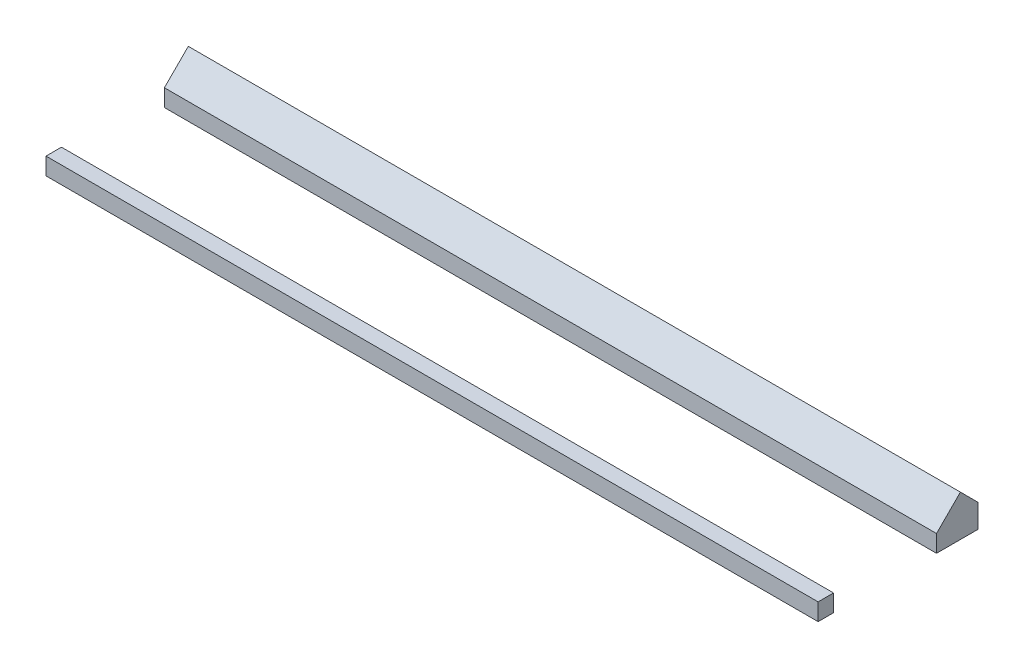
ISO-10303-21;
HEADER;
FILE_DESCRIPTION(('STEP AP214'),'2;1');
FILE_NAME('part.step','',(''),(''),'','','');
FILE_SCHEMA(('AUTOMOTIVE_DESIGN { 1 0 10303 214 1 1 1 1 }'));
ENDSEC;
DATA;
#1=APPLICATION_CONTEXT('core data for automotive mechanical design processes');
#2=APPLICATION_PROTOCOL_DEFINITION('international standard','automotive_design',2000,#1);
#3=PRODUCT_CONTEXT('',#1,'mechanical');
#4=PRODUCT('Part','Part','',(#3));
#5=PRODUCT_RELATED_PRODUCT_CATEGORY('part','',(#4));
#6=PRODUCT_DEFINITION_FORMATION('','',#4);
#7=PRODUCT_DEFINITION_CONTEXT('part definition',#1,'design');
#8=PRODUCT_DEFINITION('design','',#6,#7);
#9=PRODUCT_DEFINITION_SHAPE('','',#8);
#10=(LENGTH_UNIT() NAMED_UNIT(*) SI_UNIT(.MILLI.,.METRE.));
#11=(NAMED_UNIT(*) PLANE_ANGLE_UNIT() SI_UNIT($,.RADIAN.));
#12=(NAMED_UNIT(*) SI_UNIT($,.STERADIAN.) SOLID_ANGLE_UNIT());
#13=UNCERTAINTY_MEASURE_WITH_UNIT(LENGTH_MEASURE(1.E-05),#10,'distance_accuracy_value','');
#14=(GEOMETRIC_REPRESENTATION_CONTEXT(3) GLOBAL_UNCERTAINTY_ASSIGNED_CONTEXT((#13)) GLOBAL_UNIT_ASSIGNED_CONTEXT((#10,
#11,#12)) REPRESENTATION_CONTEXT('',''));
#15=CARTESIAN_POINT('',(0.,0.,0.));
#16=DIRECTION('',(0.,0.,1.));
#17=DIRECTION('',(1.,0.,0.));
#18=AXIS2_PLACEMENT_3D('',#15,#16,#17);
#19=CARTESIAN_POINT('',(900.,20.,60.));
#20=DIRECTION('',(0.,0.,1.));
#21=DIRECTION('',(1.,0.,0.));
#22=AXIS2_PLACEMENT_3D('',#19,#20,#21);
#23=PLANE('',#22);
#24=DIRECTION('',(0.,1.,0.));
#25=VECTOR('',#24,1.);
#26=CARTESIAN_POINT('',(0.,20.,60.));
#27=LINE('',#26,#25);
#28=CARTESIAN_POINT('',(0.,0.,60.));
#29=VERTEX_POINT('',#28);
#30=CARTESIAN_POINT('',(0.,20.,60.));
#31=VERTEX_POINT('',#30);
#32=EDGE_CURVE('E12',#29,#31,#27,.T.);
#33=ORIENTED_EDGE('',*,*,#32,.T.);
#34=DIRECTION('',(-1.,0.,0.));
#35=VECTOR('',#34,1.);
#36=CARTESIAN_POINT('',(900.,20.,60.));
#37=LINE('',#36,#35);
#38=CARTESIAN_POINT('',(900.,20.,60.));
#39=VERTEX_POINT('',#38);
#40=EDGE_CURVE('E136',#39,#31,#37,.T.);
#41=ORIENTED_EDGE('',*,*,#40,.F.);
#42=DIRECTION('',(0.,1.,0.));
#43=VECTOR('',#42,1.);
#44=CARTESIAN_POINT('',(900.,20.,60.));
#45=LINE('',#44,#43);
#46=CARTESIAN_POINT('',(900.,0.,60.));
#47=VERTEX_POINT('',#46);
#48=EDGE_CURVE('E52',#47,#39,#45,.T.);
#49=ORIENTED_EDGE('',*,*,#48,.F.);
#50=DIRECTION('',(-1.,0.,0.));
#51=VECTOR('',#50,1.);
#52=CARTESIAN_POINT('',(900.,0.,60.));
#53=LINE('',#52,#51);
#54=EDGE_CURVE('E110',#47,#29,#53,.T.);
#55=ORIENTED_EDGE('',*,*,#54,.T.);
#56=EDGE_LOOP('',(#33,#41,#49,#55));
#57=FACE_BOUND('',#56,.T.);
#58=ADVANCED_FACE('F48',(#57),#23,.F.);
#59=CARTESIAN_POINT('',(900.,20.,60.));
#60=DIRECTION('',(0.,-1.,0.));
#61=DIRECTION('',(0.,0.,-1.));
#62=AXIS2_PLACEMENT_3D('',#59,#60,#61);
#63=PLANE('',#62);
#64=DIRECTION('',(0.,0.,1.));
#65=VECTOR('',#64,1.);
#66=CARTESIAN_POINT('',(0.,20.,60.));
#67=LINE('',#66,#65);
#68=CARTESIAN_POINT('',(0.,20.,78.));
#69=VERTEX_POINT('',#68);
#70=EDGE_CURVE('E59',#31,#69,#67,.T.);
#71=ORIENTED_EDGE('',*,*,#70,.T.);
#72=DIRECTION('',(-1.,0.,0.));
#73=VECTOR('',#72,1.);
#74=CARTESIAN_POINT('',(900.,20.,78.));
#75=LINE('',#74,#73);
#76=CARTESIAN_POINT('',(900.,20.,78.));
#77=VERTEX_POINT('',#76);
#78=EDGE_CURVE('E104',#77,#69,#75,.T.);
#79=ORIENTED_EDGE('',*,*,#78,.F.);
#80=DIRECTION('',(0.,0.,1.));
#81=VECTOR('',#80,1.);
#82=CARTESIAN_POINT('',(900.,20.,60.));
#83=LINE('',#82,#81);
#84=EDGE_CURVE('E83',#39,#77,#83,.T.);
#85=ORIENTED_EDGE('',*,*,#84,.F.);
#86=ORIENTED_EDGE('',*,*,#40,.T.);
#87=EDGE_LOOP('',(#71,#79,#85,#86));
#88=FACE_BOUND('',#87,.T.);
#89=ADVANCED_FACE('F141',(#88),#63,.F.);
#90=CARTESIAN_POINT('',(900.,20.,78.));
#91=DIRECTION('',(0.,0.,-1.));
#92=DIRECTION('',(-1.,0.,0.));
#93=AXIS2_PLACEMENT_3D('',#90,#91,#92);
#94=PLANE('',#93);
#95=DIRECTION('',(0.,-1.,0.));
#96=VECTOR('',#95,1.);
#97=CARTESIAN_POINT('',(0.,20.,78.));
#98=LINE('',#97,#96);
#99=CARTESIAN_POINT('',(0.,0.,78.));
#100=VERTEX_POINT('',#99);
#101=EDGE_CURVE('E99',#69,#100,#98,.T.);
#102=ORIENTED_EDGE('',*,*,#101,.T.);
#103=DIRECTION('',(-1.,0.,0.));
#104=VECTOR('',#103,1.);
#105=CARTESIAN_POINT('',(900.,0.,78.));
#106=LINE('',#105,#104);
#107=CARTESIAN_POINT('',(900.,0.,78.));
#108=VERTEX_POINT('',#107);
#109=EDGE_CURVE('E102',#108,#100,#106,.T.);
#110=ORIENTED_EDGE('',*,*,#109,.F.);
#111=DIRECTION('',(0.,-1.,0.));
#112=VECTOR('',#111,1.);
#113=CARTESIAN_POINT('',(900.,20.,78.));
#114=LINE('',#113,#112);
#115=EDGE_CURVE('E123',#77,#108,#114,.T.);
#116=ORIENTED_EDGE('',*,*,#115,.F.);
#117=ORIENTED_EDGE('',*,*,#78,.T.);
#118=EDGE_LOOP('',(#102,#110,#116,#117));
#119=FACE_BOUND('',#118,.T.);
#120=ADVANCED_FACE('F100',(#119),#94,.F.);
#121=CARTESIAN_POINT('',(900.,0.,78.));
#122=DIRECTION('',(0.,1.,0.));
#123=DIRECTION('',(0.,0.,1.));
#124=AXIS2_PLACEMENT_3D('',#121,#122,#123);
#125=PLANE('',#124);
#126=DIRECTION('',(0.,0.,-1.));
#127=VECTOR('',#126,1.);
#128=CARTESIAN_POINT('',(0.,0.,78.));
#129=LINE('',#128,#127);
#130=EDGE_CURVE('E93',#100,#29,#129,.T.);
#131=ORIENTED_EDGE('',*,*,#130,.T.);
#132=ORIENTED_EDGE('',*,*,#54,.F.);
#133=DIRECTION('',(0.,0.,-1.));
#134=VECTOR('',#133,1.);
#135=CARTESIAN_POINT('',(900.,0.,78.));
#136=LINE('',#135,#134);
#137=EDGE_CURVE('E108',#108,#47,#136,.T.);
#138=ORIENTED_EDGE('',*,*,#137,.F.);
#139=ORIENTED_EDGE('',*,*,#109,.T.);
#140=EDGE_LOOP('',(#131,#132,#138,#139));
#141=FACE_BOUND('',#140,.T.);
#142=ADVANCED_FACE('F107',(#141),#125,.F.);
#143=CARTESIAN_POINT('',(900.,0.,2.4980018054066E-13));
#144=DIRECTION('',(1.,0.,0.));
#145=DIRECTION('',(0.,0.,-1.));
#146=AXIS2_PLACEMENT_3D('',#143,#144,#145);
#147=PLANE('',#146);
#148=ORIENTED_EDGE('',*,*,#48,.T.);
#149=ORIENTED_EDGE('',*,*,#84,.T.);
#150=ORIENTED_EDGE('',*,*,#115,.T.);
#151=ORIENTED_EDGE('',*,*,#137,.T.);
#152=EDGE_LOOP('',(#148,#149,#150,#151));
#153=FACE_BOUND('',#152,.T.);
#154=ADVANCED_FACE('F50',(#153),#147,.T.);
#155=CARTESIAN_POINT('',(0.,0.,0.));
#156=DIRECTION('',(1.,0.,0.));
#157=DIRECTION('',(0.,0.,-1.));
#158=AXIS2_PLACEMENT_3D('',#155,#156,#157);
#159=PLANE('',#158);
#160=ORIENTED_EDGE('',*,*,#32,.F.);
#161=ORIENTED_EDGE('',*,*,#130,.F.);
#162=ORIENTED_EDGE('',*,*,#101,.F.);
#163=ORIENTED_EDGE('',*,*,#70,.F.);
#164=EDGE_LOOP('',(#160,#161,#162,#163));
#165=FACE_BOUND('',#164,.T.);
#166=ADVANCED_FACE('F112',(#165),#159,.F.);
#167=CLOSED_SHELL('',(#58,#89,#120,#142,#154,#166));
#168=MANIFOLD_SOLID_BREP('B2',#167);
#169=CARTESIAN_POINT('',(900.,0.,-59.9999999999999));
#170=DIRECTION('',(0.,1.,0.));
#171=DIRECTION('',(0.,0.,1.));
#172=AXIS2_PLACEMENT_3D('',#169,#170,#171);
#173=PLANE('',#172);
#174=DIRECTION('',(0.,0.,-1.));
#175=VECTOR('',#174,1.);
#176=CARTESIAN_POINT('',(0.,0.,-59.9999999999999));
#177=LINE('',#176,#175);
#178=CARTESIAN_POINT('',(0.,0.,-59.9999999999999));
#179=VERTEX_POINT('',#178);
#180=CARTESIAN_POINT('',(0.,0.,-108.36610383316));
#181=VERTEX_POINT('',#180);
#182=EDGE_CURVE('E275',#179,#181,#177,.T.);
#183=ORIENTED_EDGE('',*,*,#182,.T.);
#184=DIRECTION('',(-1.,0.,0.));
#185=VECTOR('',#184,1.);
#186=CARTESIAN_POINT('',(900.,0.,-108.36610383316));
#187=LINE('',#186,#185);
#188=CARTESIAN_POINT('',(900.,0.,-108.36610383316));
#189=VERTEX_POINT('',#188);
#190=EDGE_CURVE('E46',#189,#181,#187,.T.);
#191=ORIENTED_EDGE('',*,*,#190,.F.);
#192=DIRECTION('',(0.,0.,-1.));
#193=VECTOR('',#192,1.);
#194=CARTESIAN_POINT('',(900.,0.,-59.9999999999999));
#195=LINE('',#194,#193);
#196=CARTESIAN_POINT('',(900.,0.,-59.9999999999999));
#197=VERTEX_POINT('',#196);
#198=EDGE_CURVE('E288',#197,#189,#195,.T.);
#199=ORIENTED_EDGE('',*,*,#198,.F.);
#200=DIRECTION('',(-1.,0.,0.));
#201=VECTOR('',#200,1.);
#202=CARTESIAN_POINT('',(900.,0.,-59.9999999999999));
#203=LINE('',#202,#201);
#204=EDGE_CURVE('E271',#197,#179,#203,.T.);
#205=ORIENTED_EDGE('',*,*,#204,.T.);
#206=EDGE_LOOP('',(#183,#191,#199,#205));
#207=FACE_BOUND('',#206,.T.);
#208=ADVANCED_FACE('F195',(#207),#173,.F.);
#209=CARTESIAN_POINT('',(900.,27.35391052434,-108.36610383316));
#210=DIRECTION('',(0.,0.,1.));
#211=DIRECTION('',(1.,0.,0.));
#212=AXIS2_PLACEMENT_3D('',#209,#210,#211);
#213=PLANE('',#212);
#214=DIRECTION('',(0.,1.,0.));
#215=VECTOR('',#214,1.);
#216=CARTESIAN_POINT('',(0.,27.35391052434,-108.36610383316));
#217=LINE('',#216,#215);
#218=CARTESIAN_POINT('',(0.,27.35391052434,-108.36610383316));
#219=VERTEX_POINT('',#218);
#220=EDGE_CURVE('E279',#181,#219,#217,.T.);
#221=ORIENTED_EDGE('',*,*,#220,.T.);
#222=DIRECTION('',(-1.,0.,0.));
#223=VECTOR('',#222,1.);
#224=CARTESIAN_POINT('',(900.,27.35391052434,-108.36610383316));
#225=LINE('',#224,#223);
#226=CARTESIAN_POINT('',(900.,27.35391052434,-108.36610383316));
#227=VERTEX_POINT('',#226);
#228=EDGE_CURVE('E204',#227,#219,#225,.T.);
#229=ORIENTED_EDGE('',*,*,#228,.F.);
#230=DIRECTION('',(0.,1.,0.));
#231=VECTOR('',#230,1.);
#232=CARTESIAN_POINT('',(900.,27.35391052434,-108.36610383316));
#233=LINE('',#232,#231);
#234=EDGE_CURVE('E246',#189,#227,#233,.T.);
#235=ORIENTED_EDGE('',*,*,#234,.F.);
#236=ORIENTED_EDGE('',*,*,#190,.T.);
#237=EDGE_LOOP('',(#221,#229,#235,#236));
#238=FACE_BOUND('',#237,.T.);
#239=ADVANCED_FACE('F311',(#238),#213,.F.);
#240=CARTESIAN_POINT('',(900.,47.8600071787499,-87.8600071787499));
#241=DIRECTION('',(0.,-0.707106781186547,0.707106781186548));
#242=DIRECTION('',(0.,-0.707106781186548,-0.707106781186547));
#243=AXIS2_PLACEMENT_3D('',#240,#241,#242);
#244=PLANE('',#243);
#245=DIRECTION('',(0.,0.707106781186548,0.707106781186547));
#246=VECTOR('',#245,1.);
#247=CARTESIAN_POINT('',(0.,47.8600071787499,-87.8600071787499));
#248=LINE('',#247,#246);
#249=CARTESIAN_POINT('',(0.,47.8600071787499,-87.8600071787499));
#250=VERTEX_POINT('',#249);
#251=EDGE_CURVE('E262',#219,#250,#248,.T.);
#252=ORIENTED_EDGE('',*,*,#251,.T.);
#253=DIRECTION('',(-1.,0.,0.));
#254=VECTOR('',#253,1.);
#255=CARTESIAN_POINT('',(900.,47.8600071787499,-87.8600071787499));
#256=LINE('',#255,#254);
#257=CARTESIAN_POINT('',(900.,47.8600071787499,-87.8600071787499));
#258=VERTEX_POINT('',#257);
#259=EDGE_CURVE('E259',#258,#250,#256,.T.);
#260=ORIENTED_EDGE('',*,*,#259,.F.);
#261=DIRECTION('',(0.,0.707106781186548,0.707106781186547));
#262=VECTOR('',#261,1.);
#263=CARTESIAN_POINT('',(900.,47.8600071787499,-87.8600071787499));
#264=LINE('',#263,#262);
#265=EDGE_CURVE('E250',#227,#258,#264,.T.);
#266=ORIENTED_EDGE('',*,*,#265,.F.);
#267=ORIENTED_EDGE('',*,*,#228,.T.);
#268=EDGE_LOOP('',(#252,#260,#266,#267));
#269=FACE_BOUND('',#268,.T.);
#270=ADVANCED_FACE('F260',(#269),#244,.F.);
#271=CARTESIAN_POINT('',(900.,47.8600071787499,-87.8600071787499));
#272=DIRECTION('',(0.,-0.707106781186548,-0.707106781186547));
#273=DIRECTION('',(0.,0.707106781186547,-0.707106781186548));
#274=AXIS2_PLACEMENT_3D('',#271,#272,#273);
#275=PLANE('',#274);
#276=DIRECTION('',(0.,-0.707106781186547,0.707106781186548));
#277=VECTOR('',#276,1.);
#278=CARTESIAN_POINT('',(0.,47.8600071787499,-87.8600071787499));
#279=LINE('',#278,#277);
#280=CARTESIAN_POINT('',(0.,20.,-59.9999999999999));
#281=VERTEX_POINT('',#280);
#282=EDGE_CURVE('E232',#250,#281,#279,.T.);
#283=ORIENTED_EDGE('',*,*,#282,.T.);
#284=DIRECTION('',(-1.,0.,0.));
#285=VECTOR('',#284,1.);
#286=CARTESIAN_POINT('',(900.,20.,-59.9999999999999));
#287=LINE('',#286,#285);
#288=CARTESIAN_POINT('',(900.,20.,-59.9999999999999));
#289=VERTEX_POINT('',#288);
#290=EDGE_CURVE('E264',#289,#281,#287,.T.);
#291=ORIENTED_EDGE('',*,*,#290,.F.);
#292=DIRECTION('',(0.,-0.707106781186547,0.707106781186548));
#293=VECTOR('',#292,1.);
#294=CARTESIAN_POINT('',(900.,47.8600071787499,-87.8600071787499));
#295=LINE('',#294,#293);
#296=EDGE_CURVE('E254',#258,#289,#295,.T.);
#297=ORIENTED_EDGE('',*,*,#296,.F.);
#298=ORIENTED_EDGE('',*,*,#259,.T.);
#299=EDGE_LOOP('',(#283,#291,#297,#298));
#300=FACE_BOUND('',#299,.T.);
#301=ADVANCED_FACE('F266',(#300),#275,.F.);
#302=CARTESIAN_POINT('',(900.,20.,-59.9999999999999));
#303=DIRECTION('',(0.,0.,-1.));
#304=DIRECTION('',(-1.,0.,0.));
#305=AXIS2_PLACEMENT_3D('',#302,#303,#304);
#306=PLANE('',#305);
#307=DIRECTION('',(0.,-1.,0.));
#308=VECTOR('',#307,1.);
#309=CARTESIAN_POINT('',(0.,20.,-59.9999999999999));
#310=LINE('',#309,#308);
#311=EDGE_CURVE('E238',#281,#179,#310,.T.);
#312=ORIENTED_EDGE('',*,*,#311,.T.);
#313=ORIENTED_EDGE('',*,*,#204,.F.);
#314=DIRECTION('',(0.,-1.,0.));
#315=VECTOR('',#314,1.);
#316=CARTESIAN_POINT('',(900.,20.,-59.9999999999999));
#317=LINE('',#316,#315);
#318=EDGE_CURVE('E212',#289,#197,#317,.T.);
#319=ORIENTED_EDGE('',*,*,#318,.F.);
#320=ORIENTED_EDGE('',*,*,#290,.T.);
#321=EDGE_LOOP('',(#312,#313,#319,#320));
#322=FACE_BOUND('',#321,.T.);
#323=ADVANCED_FACE('F300',(#322),#306,.F.);
#324=CARTESIAN_POINT('',(900.,0.,2.4980018054066E-13));
#325=DIRECTION('',(-1.,0.,0.));
#326=DIRECTION('',(0.,0.,1.));
#327=AXIS2_PLACEMENT_3D('',#324,#325,#326);
#328=PLANE('',#327);
#329=ORIENTED_EDGE('',*,*,#198,.T.);
#330=ORIENTED_EDGE('',*,*,#234,.T.);
#331=ORIENTED_EDGE('',*,*,#265,.T.);
#332=ORIENTED_EDGE('',*,*,#296,.T.);
#333=ORIENTED_EDGE('',*,*,#318,.T.);
#334=EDGE_LOOP('',(#329,#330,#331,#332,#333));
#335=FACE_BOUND('',#334,.T.);
#336=ADVANCED_FACE('F252',(#335),#328,.F.);
#337=CARTESIAN_POINT('',(0.,0.,0.));
#338=DIRECTION('',(-1.,0.,0.));
#339=DIRECTION('',(0.,0.,1.));
#340=AXIS2_PLACEMENT_3D('',#337,#338,#339);
#341=PLANE('',#340);
#342=ORIENTED_EDGE('',*,*,#182,.F.);
#343=ORIENTED_EDGE('',*,*,#311,.F.);
#344=ORIENTED_EDGE('',*,*,#282,.F.);
#345=ORIENTED_EDGE('',*,*,#251,.F.);
#346=ORIENTED_EDGE('',*,*,#220,.F.);
#347=EDGE_LOOP('',(#342,#343,#344,#345,#346));
#348=FACE_BOUND('',#347,.T.);
#349=ADVANCED_FACE('F296',(#348),#341,.T.);
#350=CLOSED_SHELL('',(#208,#239,#270,#301,#323,#336,#349));
#351=MANIFOLD_SOLID_BREP('B6',#350);
#352=ADVANCED_BREP_SHAPE_REPRESENTATION('',(#18,#168,#351),#14);
#353=SHAPE_DEFINITION_REPRESENTATION(#9,#352);
ENDSEC;
END-ISO-10303-21;
